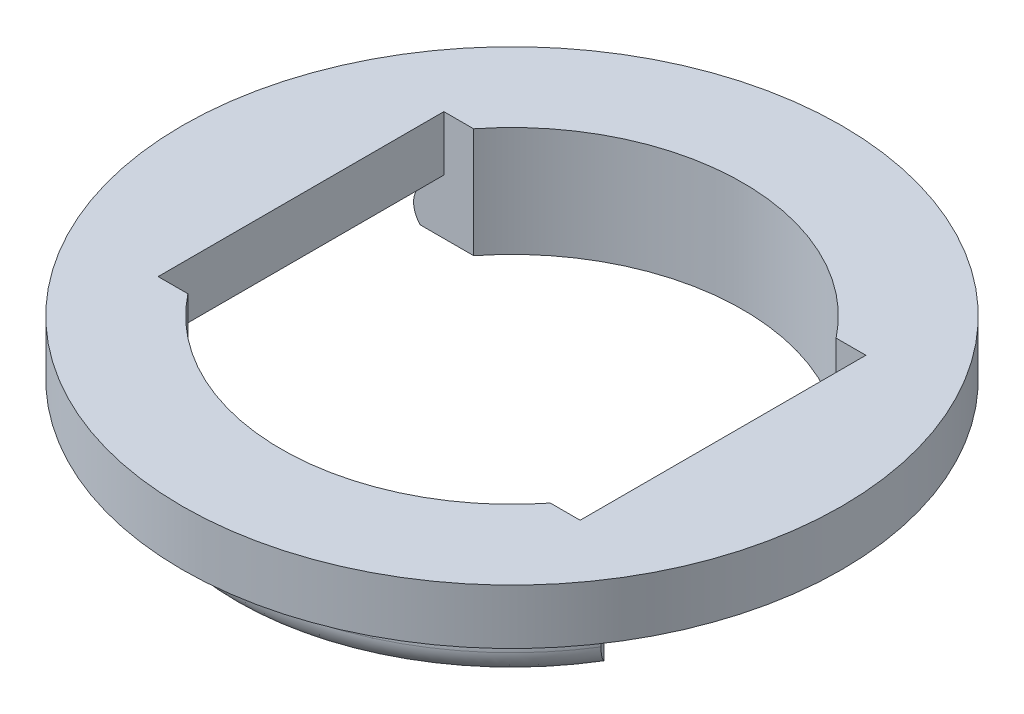
ISO-10303-21;
HEADER;
FILE_DESCRIPTION(('STEP AP214'),'2;1');
FILE_NAME('part.step','',(''),(''),'','','');
FILE_SCHEMA(('AUTOMOTIVE_DESIGN { 1 0 10303 214 1 1 1 1 }'));
ENDSEC;
DATA;
#1=APPLICATION_CONTEXT('core data for automotive mechanical design processes');
#2=APPLICATION_PROTOCOL_DEFINITION('international standard','automotive_design',2000,#1);
#3=PRODUCT_CONTEXT('',#1,'mechanical');
#4=PRODUCT('Part','Part','',(#3));
#5=PRODUCT_RELATED_PRODUCT_CATEGORY('part','',(#4));
#6=PRODUCT_DEFINITION_FORMATION('','',#4);
#7=PRODUCT_DEFINITION_CONTEXT('part definition',#1,'design');
#8=PRODUCT_DEFINITION('design','',#6,#7);
#9=PRODUCT_DEFINITION_SHAPE('','',#8);
#10=(LENGTH_UNIT() NAMED_UNIT(*) SI_UNIT(.MILLI.,.METRE.));
#11=(NAMED_UNIT(*) PLANE_ANGLE_UNIT() SI_UNIT($,.RADIAN.));
#12=(NAMED_UNIT(*) SI_UNIT($,.STERADIAN.) SOLID_ANGLE_UNIT());
#13=UNCERTAINTY_MEASURE_WITH_UNIT(LENGTH_MEASURE(1.E-05),#10,'distance_accuracy_value','');
#14=(GEOMETRIC_REPRESENTATION_CONTEXT(3) GLOBAL_UNCERTAINTY_ASSIGNED_CONTEXT((#13)) GLOBAL_UNIT_ASSIGNED_CONTEXT((#10,
#11,#12)) REPRESENTATION_CONTEXT('',''));
#15=CARTESIAN_POINT('',(0.,0.,0.));
#16=DIRECTION('',(0.,0.,1.));
#17=DIRECTION('',(1.,0.,0.));
#18=AXIS2_PLACEMENT_3D('',#15,#16,#17);
#19=CARTESIAN_POINT('',(0.,-2.5,0.));
#20=DIRECTION('',(0.,1.,0.));
#21=DIRECTION('',(0.,0.,1.));
#22=AXIS2_PLACEMENT_3D('',#19,#20,#21);
#23=CYLINDRICAL_SURFACE('',#22,12.5);
#24=CARTESIAN_POINT('',(0.,-1.,0.));
#25=DIRECTION('',(0.,-1.,0.));
#26=DIRECTION('',(-0.854166260162505,0.,-0.52));
#27=AXIS2_PLACEMENT_3D('',#24,#25,#26);
#28=CIRCLE('',#27,12.5);
#29=CARTESIAN_POINT('',(-10.6770782520313,-1.,-6.5));
#30=VERTEX_POINT('',#29);
#31=CARTESIAN_POINT('',(10.6770782520313,-1.,-6.5));
#32=VERTEX_POINT('',#31);
#33=EDGE_CURVE('E58',#30,#32,#28,.T.);
#34=ORIENTED_EDGE('',*,*,#33,.F.);
#35=DIRECTION('',(0.,1.,0.));
#36=VECTOR('',#35,1.);
#37=CARTESIAN_POINT('',(-10.6770782520313,-2.5,-6.5));
#38=LINE('',#37,#36);
#39=CARTESIAN_POINT('',(-10.6770782520313,0.,-6.5));
#40=VERTEX_POINT('',#39);
#41=EDGE_CURVE('E169',#30,#40,#38,.T.);
#42=ORIENTED_EDGE('',*,*,#41,.T.);
#43=CARTESIAN_POINT('',(0.,0.,0.));
#44=DIRECTION('',(0.,-1.,0.));
#45=DIRECTION('',(0.,0.,-1.));
#46=AXIS2_PLACEMENT_3D('',#43,#44,#45);
#47=CIRCLE('',#46,12.5);
#48=CARTESIAN_POINT('',(10.6770782520313,0.,-6.5));
#49=VERTEX_POINT('',#48);
#50=EDGE_CURVE('E172',#40,#49,#47,.T.);
#51=ORIENTED_EDGE('',*,*,#50,.T.);
#52=DIRECTION('',(0.,1.,0.));
#53=VECTOR('',#52,1.);
#54=CARTESIAN_POINT('',(10.6770782520313,-2.5,-6.5));
#55=LINE('',#54,#53);
#56=EDGE_CURVE('E160',#32,#49,#55,.T.);
#57=ORIENTED_EDGE('',*,*,#56,.F.);
#58=EDGE_LOOP('',(#34,#42,#51,#57));
#59=FACE_BOUND('',#58,.T.);
#60=ADVANCED_FACE('F41',(#59),#23,.T.);
#61=CARTESIAN_POINT('',(0.,-2.5,0.));
#62=DIRECTION('',(0.,1.,0.));
#63=DIRECTION('',(0.,0.,1.));
#64=AXIS2_PLACEMENT_3D('',#61,#62,#63);
#65=CYLINDRICAL_SURFACE('',#64,12.5);
#66=CARTESIAN_POINT('',(0.,-1.,0.));
#67=DIRECTION('',(0.,-1.,0.));
#68=DIRECTION('',(0.854166260162505,0.,0.52));
#69=AXIS2_PLACEMENT_3D('',#66,#67,#68);
#70=CIRCLE('',#69,12.5);
#71=CARTESIAN_POINT('',(10.6770782520313,-1.,6.5));
#72=VERTEX_POINT('',#71);
#73=CARTESIAN_POINT('',(-10.6770782520313,-1.,6.5));
#74=VERTEX_POINT('',#73);
#75=EDGE_CURVE('E66',#72,#74,#70,.T.);
#76=ORIENTED_EDGE('',*,*,#75,.F.);
#77=DIRECTION('',(0.,1.,0.));
#78=VECTOR('',#77,1.);
#79=CARTESIAN_POINT('',(10.6770782520313,-2.5,6.5));
#80=LINE('',#79,#78);
#81=CARTESIAN_POINT('',(10.6770782520313,0.,6.5));
#82=VERTEX_POINT('',#81);
#83=EDGE_CURVE('E286',#72,#82,#80,.T.);
#84=ORIENTED_EDGE('',*,*,#83,.T.);
#85=CARTESIAN_POINT('',(0.,0.,0.));
#86=DIRECTION('',(0.,-1.,0.));
#87=DIRECTION('',(0.,0.,-1.));
#88=AXIS2_PLACEMENT_3D('',#85,#86,#87);
#89=CIRCLE('',#88,12.5);
#90=CARTESIAN_POINT('',(-10.6770782520313,0.,6.5));
#91=VERTEX_POINT('',#90);
#92=EDGE_CURVE('E259',#82,#91,#89,.T.);
#93=ORIENTED_EDGE('',*,*,#92,.T.);
#94=DIRECTION('',(0.,1.,0.));
#95=VECTOR('',#94,1.);
#96=CARTESIAN_POINT('',(-10.6770782520313,-2.5,6.5));
#97=LINE('',#96,#95);
#98=EDGE_CURVE('E283',#74,#91,#97,.T.);
#99=ORIENTED_EDGE('',*,*,#98,.F.);
#100=EDGE_LOOP('',(#76,#84,#93,#99));
#101=FACE_BOUND('',#100,.T.);
#102=ADVANCED_FACE('F359',(#101),#65,.T.);
#103=CARTESIAN_POINT('',(0.,2.5,-6.50000000000001));
#104=DIRECTION('',(0.,0.,-1.));
#105=DIRECTION('',(-1.,0.,0.));
#106=AXIS2_PLACEMENT_3D('',#103,#104,#105);
#107=PLANE('',#106);
#108=DIRECTION('',(1.,0.,0.));
#109=VECTOR('',#108,1.);
#110=CARTESIAN_POINT('',(0.,2.5,-6.50000000000001));
#111=LINE('',#110,#109);
#112=CARTESIAN_POINT('',(8.24621125123532,2.5,-6.5));
#113=VERTEX_POINT('',#112);
#114=CARTESIAN_POINT('',(9.6,2.5,-6.5));
#115=VERTEX_POINT('',#114);
#116=EDGE_CURVE('E304',#113,#115,#111,.T.);
#117=ORIENTED_EDGE('',*,*,#116,.F.);
#118=DIRECTION('',(0.,1.,0.));
#119=VECTOR('',#118,1.);
#120=CARTESIAN_POINT('',(8.24621125123532,-2.5,-6.5));
#121=LINE('',#120,#119);
#122=CARTESIAN_POINT('',(8.24621125123532,-2.5,-6.5));
#123=VERTEX_POINT('',#122);
#124=EDGE_CURVE('E175',#123,#113,#121,.T.);
#125=ORIENTED_EDGE('',*,*,#124,.F.);
#126=DIRECTION('',(-1.,0.,0.));
#127=VECTOR('',#126,1.);
#128=CARTESIAN_POINT('',(0.,-2.5,-6.5));
#129=LINE('',#128,#127);
#130=CARTESIAN_POINT('',(10.6770782520313,-2.5,-6.5));
#131=VERTEX_POINT('',#130);
#132=EDGE_CURVE('E163',#131,#123,#129,.T.);
#133=ORIENTED_EDGE('',*,*,#132,.F.);
#134=EDGE_CURVE('E157',#131,#32,#55,.T.);
#135=ORIENTED_EDGE('',*,*,#134,.T.);
#136=ORIENTED_EDGE('',*,*,#56,.T.);
#137=DIRECTION('',(-1.,0.,0.));
#138=VECTOR('',#137,1.);
#139=CARTESIAN_POINT('',(0.,0.,-6.5));
#140=LINE('',#139,#138);
#141=CARTESIAN_POINT('',(9.6,0.,-6.5));
#142=VERTEX_POINT('',#141);
#143=EDGE_CURVE('E237',#49,#142,#140,.T.);
#144=ORIENTED_EDGE('',*,*,#143,.T.);
#145=DIRECTION('',(0.,-1.,0.));
#146=VECTOR('',#145,1.);
#147=CARTESIAN_POINT('',(9.6,2.5,-6.5));
#148=LINE('',#147,#146);
#149=EDGE_CURVE('E334',#115,#142,#148,.T.);
#150=ORIENTED_EDGE('',*,*,#149,.F.);
#151=EDGE_LOOP('',(#117,#125,#133,#135,#136,#144,#150));
#152=FACE_BOUND('',#151,.T.);
#153=ADVANCED_FACE('F159',(#152),#107,.F.);
#154=CARTESIAN_POINT('',(0.,2.5,6.49999999999999));
#155=DIRECTION('',(0.,0.,1.));
#156=DIRECTION('',(1.,0.,0.));
#157=AXIS2_PLACEMENT_3D('',#154,#155,#156);
#158=PLANE('',#157);
#159=DIRECTION('',(-1.,0.,0.));
#160=VECTOR('',#159,1.);
#161=CARTESIAN_POINT('',(0.,2.5,6.49999999999999));
#162=LINE('',#161,#160);
#163=CARTESIAN_POINT('',(-8.24621125123532,2.5,6.5));
#164=VERTEX_POINT('',#163);
#165=CARTESIAN_POINT('',(-9.6,2.5,6.5));
#166=VERTEX_POINT('',#165);
#167=EDGE_CURVE('E313',#164,#166,#162,.T.);
#168=ORIENTED_EDGE('',*,*,#167,.F.);
#169=DIRECTION('',(0.,1.,0.));
#170=VECTOR('',#169,1.);
#171=CARTESIAN_POINT('',(-8.24621125123532,-2.5,6.5));
#172=LINE('',#171,#170);
#173=CARTESIAN_POINT('',(-8.24621125123532,-2.5,6.5));
#174=VERTEX_POINT('',#173);
#175=EDGE_CURVE('E273',#174,#164,#172,.T.);
#176=ORIENTED_EDGE('',*,*,#175,.F.);
#177=DIRECTION('',(1.,0.,0.));
#178=VECTOR('',#177,1.);
#179=CARTESIAN_POINT('',(0.,-2.5,6.5));
#180=LINE('',#179,#178);
#181=CARTESIAN_POINT('',(-10.6770782520313,-2.5,6.5));
#182=VERTEX_POINT('',#181);
#183=EDGE_CURVE('E271',#182,#174,#180,.T.);
#184=ORIENTED_EDGE('',*,*,#183,.F.);
#185=CARTESIAN_POINT('',(-9.88957825203131,-1.75,6.5));
#186=DIRECTION('',(0.,0.,1.));
#187=DIRECTION('',(1.,0.,0.));
#188=AXIS2_PLACEMENT_3D('',#185,#186,#187);
#189=CIRCLE('',#188,1.0875);
#190=CARTESIAN_POINT('',(-10.9770782520313,-1.75,6.5));
#191=VERTEX_POINT('',#190);
#192=EDGE_CURVE('E216',#191,#182,#189,.T.);
#193=ORIENTED_EDGE('',*,*,#192,.F.);
#194=CARTESIAN_POINT('',(-9.88957825203131,-1.75,6.5));
#195=DIRECTION('',(0.,0.,-1.));
#196=DIRECTION('',(-1.,0.,0.));
#197=AXIS2_PLACEMENT_3D('',#194,#195,#196);
#198=CIRCLE('',#197,1.0875);
#199=EDGE_CURVE('E205',#74,#191,#198,.F.);
#200=ORIENTED_EDGE('',*,*,#199,.F.);
#201=ORIENTED_EDGE('',*,*,#98,.T.);
#202=DIRECTION('',(1.,0.,0.));
#203=VECTOR('',#202,1.);
#204=CARTESIAN_POINT('',(0.,0.,6.5));
#205=LINE('',#204,#203);
#206=CARTESIAN_POINT('',(-9.6,0.,6.5));
#207=VERTEX_POINT('',#206);
#208=EDGE_CURVE('E265',#91,#207,#205,.T.);
#209=ORIENTED_EDGE('',*,*,#208,.T.);
#210=DIRECTION('',(0.,-1.,0.));
#211=VECTOR('',#210,1.);
#212=CARTESIAN_POINT('',(-9.6,2.5,6.5));
#213=LINE('',#212,#211);
#214=EDGE_CURVE('E318',#166,#207,#213,.T.);
#215=ORIENTED_EDGE('',*,*,#214,.F.);
#216=EDGE_LOOP('',(#168,#176,#184,#193,#200,#201,#209,#215));
#217=FACE_BOUND('',#216,.T.);
#218=ADVANCED_FACE('F356',(#217),#158,.F.);
#219=CARTESIAN_POINT('',(0.,0.,0.));
#220=DIRECTION('',(0.,1.,0.));
#221=DIRECTION('',(0.,0.,1.));
#222=AXIS2_PLACEMENT_3D('',#219,#220,#221);
#223=PLANE('',#222);
#224=CARTESIAN_POINT('',(0.,0.,0.));
#225=DIRECTION('',(0.,1.,0.));
#226=DIRECTION('',(0.,0.,1.));
#227=AXIS2_PLACEMENT_3D('',#224,#225,#226);
#228=CIRCLE('',#227,15.);
#229=CARTESIAN_POINT('',(0.,0.,15.));
#230=VERTEX_POINT('',#229);
#231=EDGE_CURVE('E294',#230,#230,#228,.T.);
#232=ORIENTED_EDGE('',*,*,#231,.F.);
#233=EDGE_LOOP('',(#232));
#234=FACE_BOUND('',#233,.T.);
#235=DIRECTION('',(-1.,0.,0.));
#236=VECTOR('',#235,1.);
#237=CARTESIAN_POINT('',(0.,0.,-6.50000000000001));
#238=LINE('',#237,#236);
#239=CARTESIAN_POINT('',(-9.6,0.,-6.50000000000001));
#240=VERTEX_POINT('',#239);
#241=EDGE_CURVE('E228',#240,#40,#238,.T.);
#242=ORIENTED_EDGE('',*,*,#241,.F.);
#243=DIRECTION('',(0.,0.,1.));
#244=VECTOR('',#243,1.);
#245=CARTESIAN_POINT('',(-9.6,0.,0.));
#246=LINE('',#245,#244);
#247=EDGE_CURVE('E322',#240,#207,#246,.T.);
#248=ORIENTED_EDGE('',*,*,#247,.T.);
#249=ORIENTED_EDGE('',*,*,#208,.F.);
#250=ORIENTED_EDGE('',*,*,#92,.F.);
#251=DIRECTION('',(1.,0.,0.));
#252=VECTOR('',#251,1.);
#253=CARTESIAN_POINT('',(0.,0.,6.49999999999999));
#254=LINE('',#253,#252);
#255=CARTESIAN_POINT('',(9.6,0.,6.49999999999999));
#256=VERTEX_POINT('',#255);
#257=EDGE_CURVE('E11',#256,#82,#254,.T.);
#258=ORIENTED_EDGE('',*,*,#257,.F.);
#259=DIRECTION('',(0.,0.,1.));
#260=VECTOR('',#259,1.);
#261=CARTESIAN_POINT('',(9.6,0.,0.));
#262=LINE('',#261,#260);
#263=EDGE_CURVE('E300',#142,#256,#262,.T.);
#264=ORIENTED_EDGE('',*,*,#263,.F.);
#265=ORIENTED_EDGE('',*,*,#143,.F.);
#266=ORIENTED_EDGE('',*,*,#50,.F.);
#267=EDGE_LOOP('',(#242,#248,#249,#250,#258,#264,#265,#266));
#268=FACE_BOUND('',#267,.T.);
#269=ADVANCED_FACE('F352',(#234,#268),#223,.F.);
#270=CARTESIAN_POINT('',(-9.6,2.5,0.));
#271=DIRECTION('',(1.,0.,0.));
#272=DIRECTION('',(0.,0.,-1.));
#273=AXIS2_PLACEMENT_3D('',#270,#271,#272);
#274=PLANE('',#273);
#275=ORIENTED_EDGE('',*,*,#247,.F.);
#276=DIRECTION('',(0.,-1.,0.));
#277=VECTOR('',#276,1.);
#278=CARTESIAN_POINT('',(-9.6,2.5,-6.50000000000001));
#279=LINE('',#278,#277);
#280=CARTESIAN_POINT('',(-9.6,2.5,-6.50000000000001));
#281=VERTEX_POINT('',#280);
#282=EDGE_CURVE('E45',#281,#240,#279,.T.);
#283=ORIENTED_EDGE('',*,*,#282,.F.);
#284=DIRECTION('',(0.,0.,1.));
#285=VECTOR('',#284,1.);
#286=CARTESIAN_POINT('',(-9.6,2.5,0.));
#287=LINE('',#286,#285);
#288=EDGE_CURVE('E299',#281,#166,#287,.T.);
#289=ORIENTED_EDGE('',*,*,#288,.T.);
#290=ORIENTED_EDGE('',*,*,#214,.T.);
#291=EDGE_LOOP('',(#275,#283,#289,#290));
#292=FACE_BOUND('',#291,.T.);
#293=ADVANCED_FACE('F348',(#292),#274,.T.);
#294=DIRECTION('',(0.,1.,0.));
#295=VECTOR('',#294,1.);
#296=CARTESIAN_POINT('',(-8.24621125123531,-2.5,-6.50000000000001));
#297=LINE('',#296,#295);
#298=CARTESIAN_POINT('',(-8.24621125123531,-2.5,-6.50000000000001));
#299=VERTEX_POINT('',#298);
#300=CARTESIAN_POINT('',(-8.24621125123531,2.5,-6.50000000000001));
#301=VERTEX_POINT('',#300);
#302=EDGE_CURVE('E256',#299,#301,#297,.T.);
#303=ORIENTED_EDGE('',*,*,#302,.T.);
#304=EDGE_CURVE('E305',#281,#301,#111,.T.);
#305=ORIENTED_EDGE('',*,*,#304,.F.);
#306=ORIENTED_EDGE('',*,*,#282,.T.);
#307=ORIENTED_EDGE('',*,*,#241,.T.);
#308=ORIENTED_EDGE('',*,*,#41,.F.);
#309=CARTESIAN_POINT('',(-9.88957825203131,-1.75,-6.50000000000001));
#310=DIRECTION('',(0.,0.,-1.));
#311=DIRECTION('',(-1.,0.,0.));
#312=AXIS2_PLACEMENT_3D('',#309,#310,#311);
#313=CIRCLE('',#312,1.0875);
#314=CARTESIAN_POINT('',(-10.9770782520313,-1.75,-6.50000000000001));
#315=VERTEX_POINT('',#314);
#316=EDGE_CURVE('E188',#30,#315,#313,.F.);
#317=ORIENTED_EDGE('',*,*,#316,.T.);
#318=CARTESIAN_POINT('',(-9.88957825203131,-1.75,-6.50000000000001));
#319=DIRECTION('',(0.,0.,1.));
#320=DIRECTION('',(1.,0.,0.));
#321=AXIS2_PLACEMENT_3D('',#318,#319,#320);
#322=CIRCLE('',#321,1.0875);
#323=CARTESIAN_POINT('',(-10.6770782520313,-2.5,-6.5));
#324=VERTEX_POINT('',#323);
#325=EDGE_CURVE('E190',#315,#324,#322,.T.);
#326=ORIENTED_EDGE('',*,*,#325,.T.);
#327=DIRECTION('',(-1.,0.,0.));
#328=VECTOR('',#327,1.);
#329=CARTESIAN_POINT('',(0.,-2.5,-6.50000000000001));
#330=LINE('',#329,#328);
#331=EDGE_CURVE('E236',#299,#324,#330,.T.);
#332=ORIENTED_EDGE('',*,*,#331,.F.);
#333=EDGE_LOOP('',(#303,#305,#306,#307,#308,#317,#326,#332));
#334=FACE_BOUND('',#333,.T.);
#335=ADVANCED_FACE('F345',(#334),#107,.F.);
#336=CARTESIAN_POINT('',(9.6,2.5,0.));
#337=DIRECTION('',(1.,0.,0.));
#338=DIRECTION('',(0.,0.,-1.));
#339=AXIS2_PLACEMENT_3D('',#336,#337,#338);
#340=PLANE('',#339);
#341=ORIENTED_EDGE('',*,*,#263,.T.);
#342=DIRECTION('',(0.,-1.,0.));
#343=VECTOR('',#342,1.);
#344=CARTESIAN_POINT('',(9.6,2.5,6.49999999999999));
#345=LINE('',#344,#343);
#346=CARTESIAN_POINT('',(9.6,2.5,6.49999999999999));
#347=VERTEX_POINT('',#346);
#348=EDGE_CURVE('E331',#347,#256,#345,.T.);
#349=ORIENTED_EDGE('',*,*,#348,.F.);
#350=DIRECTION('',(0.,0.,1.));
#351=VECTOR('',#350,1.);
#352=CARTESIAN_POINT('',(9.6,2.5,0.));
#353=LINE('',#352,#351);
#354=EDGE_CURVE('E309',#115,#347,#353,.T.);
#355=ORIENTED_EDGE('',*,*,#354,.F.);
#356=ORIENTED_EDGE('',*,*,#149,.T.);
#357=EDGE_LOOP('',(#341,#349,#355,#356));
#358=FACE_BOUND('',#357,.T.);
#359=ADVANCED_FACE('F366',(#358),#340,.F.);
#360=CARTESIAN_POINT('',(0.,2.5,0.));
#361=DIRECTION('',(0.,-1.,0.));
#362=DIRECTION('',(0.,0.,-1.));
#363=AXIS2_PLACEMENT_3D('',#360,#361,#362);
#364=CYLINDRICAL_SURFACE('',#363,15.);
#365=CARTESIAN_POINT('',(0.,2.5,0.));
#366=DIRECTION('',(0.,1.,0.));
#367=DIRECTION('',(0.,0.,1.));
#368=AXIS2_PLACEMENT_3D('',#365,#366,#367);
#369=CIRCLE('',#368,15.);
#370=CARTESIAN_POINT('',(0.,2.5,15.));
#371=VERTEX_POINT('',#370);
#372=EDGE_CURVE('E295',#371,#371,#369,.T.);
#373=ORIENTED_EDGE('',*,*,#372,.F.);
#374=EDGE_LOOP('',(#373));
#375=FACE_BOUND('',#374,.T.);
#376=ORIENTED_EDGE('',*,*,#231,.T.);
#377=EDGE_LOOP('',(#376));
#378=FACE_BOUND('',#377,.T.);
#379=ADVANCED_FACE('F43',(#375,#378),#364,.T.);
#380=DIRECTION('',(0.,1.,0.));
#381=VECTOR('',#380,1.);
#382=CARTESIAN_POINT('',(8.24621125123533,-2.5,6.49999999999999));
#383=LINE('',#382,#381);
#384=CARTESIAN_POINT('',(8.24621125123533,-2.5,6.49999999999999));
#385=VERTEX_POINT('',#384);
#386=CARTESIAN_POINT('',(8.24621125123533,2.5,6.49999999999999));
#387=VERTEX_POINT('',#386);
#388=EDGE_CURVE('E291',#385,#387,#383,.T.);
#389=ORIENTED_EDGE('',*,*,#388,.T.);
#390=EDGE_CURVE('E314',#347,#387,#162,.T.);
#391=ORIENTED_EDGE('',*,*,#390,.F.);
#392=ORIENTED_EDGE('',*,*,#348,.T.);
#393=ORIENTED_EDGE('',*,*,#257,.T.);
#394=ORIENTED_EDGE('',*,*,#83,.F.);
#395=CARTESIAN_POINT('',(10.6770782520313,-2.5,6.5));
#396=VERTEX_POINT('',#395);
#397=EDGE_CURVE('E287',#396,#72,#80,.T.);
#398=ORIENTED_EDGE('',*,*,#397,.F.);
#399=DIRECTION('',(1.,0.,0.));
#400=VECTOR('',#399,1.);
#401=CARTESIAN_POINT('',(0.,-2.5,6.49999999999999));
#402=LINE('',#401,#400);
#403=EDGE_CURVE('E264',#385,#396,#402,.T.);
#404=ORIENTED_EDGE('',*,*,#403,.F.);
#405=EDGE_LOOP('',(#389,#391,#392,#393,#394,#398,#404));
#406=FACE_BOUND('',#405,.T.);
#407=ADVANCED_FACE('F362',(#406),#158,.F.);
#408=CARTESIAN_POINT('',(0.,2.5,0.));
#409=DIRECTION('',(0.,1.,0.));
#410=DIRECTION('',(0.,0.,1.));
#411=AXIS2_PLACEMENT_3D('',#408,#409,#410);
#412=PLANE('',#411);
#413=CARTESIAN_POINT('',(0.,2.5,0.));
#414=DIRECTION('',(0.,-1.,0.));
#415=DIRECTION('',(0.,0.,-1.));
#416=AXIS2_PLACEMENT_3D('',#413,#414,#415);
#417=CIRCLE('',#416,10.5);
#418=EDGE_CURVE('E224',#387,#164,#417,.T.);
#419=ORIENTED_EDGE('',*,*,#418,.T.);
#420=ORIENTED_EDGE('',*,*,#167,.T.);
#421=ORIENTED_EDGE('',*,*,#288,.F.);
#422=ORIENTED_EDGE('',*,*,#304,.T.);
#423=CARTESIAN_POINT('',(0.,2.5,0.));
#424=DIRECTION('',(0.,-1.,0.));
#425=DIRECTION('',(0.,0.,-1.));
#426=AXIS2_PLACEMENT_3D('',#423,#424,#425);
#427=CIRCLE('',#426,10.5);
#428=EDGE_CURVE('E223',#301,#113,#427,.T.);
#429=ORIENTED_EDGE('',*,*,#428,.T.);
#430=ORIENTED_EDGE('',*,*,#116,.T.);
#431=ORIENTED_EDGE('',*,*,#354,.T.);
#432=ORIENTED_EDGE('',*,*,#390,.T.);
#433=EDGE_LOOP('',(#419,#420,#421,#422,#429,#430,#431,#432));
#434=FACE_BOUND('',#433,.T.);
#435=ORIENTED_EDGE('',*,*,#372,.T.);
#436=EDGE_LOOP('',(#435));
#437=FACE_BOUND('',#436,.T.);
#438=ADVANCED_FACE('F371',(#434,#437),#412,.T.);
#439=CARTESIAN_POINT('',(0.,-2.5,0.));
#440=DIRECTION('',(0.,1.,0.));
#441=DIRECTION('',(0.,0.,1.));
#442=AXIS2_PLACEMENT_3D('',#439,#440,#441);
#443=CYLINDRICAL_SURFACE('',#442,10.5);
#444=ORIENTED_EDGE('',*,*,#175,.T.);
#445=ORIENTED_EDGE('',*,*,#418,.F.);
#446=ORIENTED_EDGE('',*,*,#388,.F.);
#447=CARTESIAN_POINT('',(0.,-2.5,0.));
#448=DIRECTION('',(0.,-1.,0.));
#449=DIRECTION('',(0.,0.,-1.));
#450=AXIS2_PLACEMENT_3D('',#447,#448,#449);
#451=CIRCLE('',#450,10.5);
#452=EDGE_CURVE('E260',#385,#174,#451,.T.);
#453=ORIENTED_EDGE('',*,*,#452,.T.);
#454=EDGE_LOOP('',(#444,#445,#446,#453));
#455=FACE_BOUND('',#454,.T.);
#456=ADVANCED_FACE('F378',(#455),#443,.F.);
#457=CARTESIAN_POINT('',(0.,-2.5,0.));
#458=DIRECTION('',(0.,-1.,0.));
#459=DIRECTION('',(0.,0.,-1.));
#460=AXIS2_PLACEMENT_3D('',#457,#458,#459);
#461=PLANE('',#460);
#462=ORIENTED_EDGE('',*,*,#452,.F.);
#463=ORIENTED_EDGE('',*,*,#403,.T.);
#464=CARTESIAN_POINT('',(0.,-2.5,0.));
#465=DIRECTION('',(0.,-1.,0.));
#466=DIRECTION('',(0.,0.,-1.));
#467=AXIS2_PLACEMENT_3D('',#464,#465,#466);
#468=CIRCLE('',#467,12.5);
#469=EDGE_CURVE('E268',#396,#182,#468,.T.);
#470=ORIENTED_EDGE('',*,*,#469,.T.);
#471=ORIENTED_EDGE('',*,*,#183,.T.);
#472=EDGE_LOOP('',(#462,#463,#470,#471));
#473=FACE_BOUND('',#472,.T.);
#474=ADVANCED_FACE('F381',(#473),#461,.T.);
#475=CARTESIAN_POINT('',(0.,-2.5,0.));
#476=DIRECTION('',(0.,1.,0.));
#477=DIRECTION('',(0.,0.,1.));
#478=AXIS2_PLACEMENT_3D('',#475,#476,#477);
#479=CYLINDRICAL_SURFACE('',#478,10.5);
#480=ORIENTED_EDGE('',*,*,#124,.T.);
#481=ORIENTED_EDGE('',*,*,#428,.F.);
#482=ORIENTED_EDGE('',*,*,#302,.F.);
#483=CARTESIAN_POINT('',(0.,-2.5,0.));
#484=DIRECTION('',(0.,-1.,0.));
#485=DIRECTION('',(0.,0.,-1.));
#486=AXIS2_PLACEMENT_3D('',#483,#484,#485);
#487=CIRCLE('',#486,10.5);
#488=EDGE_CURVE('E232',#299,#123,#487,.T.);
#489=ORIENTED_EDGE('',*,*,#488,.T.);
#490=EDGE_LOOP('',(#480,#481,#482,#489));
#491=FACE_BOUND('',#490,.T.);
#492=ADVANCED_FACE('F399',(#491),#479,.F.);
#493=CARTESIAN_POINT('',(0.,-2.5,0.));
#494=DIRECTION('',(0.,-1.,0.));
#495=DIRECTION('',(0.,0.,-1.));
#496=AXIS2_PLACEMENT_3D('',#493,#494,#495);
#497=PLANE('',#496);
#498=ORIENTED_EDGE('',*,*,#488,.F.);
#499=ORIENTED_EDGE('',*,*,#331,.T.);
#500=CARTESIAN_POINT('',(0.,-2.5,0.));
#501=DIRECTION('',(0.,-1.,0.));
#502=DIRECTION('',(0.,0.,-1.));
#503=AXIS2_PLACEMENT_3D('',#500,#501,#502);
#504=CIRCLE('',#503,12.5);
#505=EDGE_CURVE('E240',#324,#131,#504,.T.);
#506=ORIENTED_EDGE('',*,*,#505,.T.);
#507=ORIENTED_EDGE('',*,*,#132,.T.);
#508=EDGE_LOOP('',(#498,#499,#506,#507));
#509=FACE_BOUND('',#508,.T.);
#510=ADVANCED_FACE('F391',(#509),#497,.T.);
#511=CARTESIAN_POINT('',(10.3154582520313,-1.75,5.80043783292691));
#512=DIRECTION('',(-0.888332910569005,0.,0.4592));
#513=DIRECTION('',(0.4592,0.,0.888332910569005));
#514=AXIS2_PLACEMENT_3D('',#511,#512,#513);
#515=PLANE('',#514);
#516=ORIENTED_EDGE('',*,*,#397,.T.);
#517=CARTESIAN_POINT('',(10.3154582520313,-1.75,5.80043783292691));
#518=DIRECTION('',(-0.888332910569005,0.,0.4592));
#519=DIRECTION('',(0.4592,0.,0.888332910569005));
#520=AXIS2_PLACEMENT_3D('',#517,#518,#519);
#521=CIRCLE('',#520,1.0875);
#522=CARTESIAN_POINT('',(10.8148382520313,-1.75,6.7664998731707));
#523=VERTEX_POINT('',#522);
#524=EDGE_CURVE('E202',#72,#523,#521,.F.);
#525=ORIENTED_EDGE('',*,*,#524,.T.);
#526=CARTESIAN_POINT('',(10.3154582520313,-1.75,5.80043783292691));
#527=DIRECTION('',(0.888332910569005,0.,-0.4592));
#528=DIRECTION('',(-0.4592,0.,-0.888332910569005));
#529=AXIS2_PLACEMENT_3D('',#526,#527,#528);
#530=CIRCLE('',#529,1.0875);
#531=EDGE_CURVE('E206',#523,#396,#530,.T.);
#532=ORIENTED_EDGE('',*,*,#531,.T.);
#533=EDGE_LOOP('',(#516,#525,#532));
#534=FACE_BOUND('',#533,.T.);
#535=ADVANCED_FACE('F389',(#534),#515,.F.);
#536=CARTESIAN_POINT('',(10.6770782520313,-1.,6.5));
#537=CARTESIAN_POINT('',(5.23386188825064,-1.,15.4411764705882));
#538=CARTESIAN_POINT('',(-5.23386188825065,-1.,15.4411764705882));
#539=CARTESIAN_POINT('',(-10.6770782520313,-1.,6.5));
#540=CARTESIAN_POINT('',(10.7666190543087,-1.20474268813417,6.67321873149329));
#541=CARTESIAN_POINT('',(5.17834622379297,-1.20474268813417,15.6893782728788));
#542=CARTESIAN_POINT('',(-5.42885492456891,-1.20474268813417,15.6044671299899));
#543=CARTESIAN_POINT('',(-10.8720712883496,-1.20474268813417,6.5));
#544=CARTESIAN_POINT('',(10.8148382520313,-1.46726009733852,6.7664998731707));
#545=CARTESIAN_POINT('',(5.14845012354476,-1.46726009733852,15.823039033955));
#546=CARTESIAN_POINT('',(-5.53386188825065,-1.46726009733852,15.6924018412243));
#547=CARTESIAN_POINT('',(-10.9770782520313,-1.46726009733852,6.5));
#548=CARTESIAN_POINT('',(10.8148382520313,-1.75,6.7664998731707));
#549=CARTESIAN_POINT('',(5.14845012354476,-1.75,15.823039033955));
#550=CARTESIAN_POINT('',(-5.53386188825065,-1.75,15.6924018412243));
#551=CARTESIAN_POINT('',(-10.9770782520313,-1.75,6.5));
#552=(BOUNDED_SURFACE() B_SPLINE_SURFACE(3,3,((#536,#537,#538,#539),(#540,#541,#542,#543),(#544,
#545,#546,#547),(#548,#549,#550,#551)),.UNSPECIFIED.,.F.,.F.,
.F.) B_SPLINE_SURFACE_WITH_KNOTS((4,4),(4,4),(0.,1.),(0.,1.),
.UNSPECIFIED.) GEOMETRIC_REPRESENTATION_ITEM() RATIONAL_B_SPLINE_SURFACE(((1.,0.68,0.68,1.),
(0.952317793923506,0.647576099867984,0.647576099867984,0.952317793923506),(0.952317793923506,
0.647576099867984,0.647576099867984,0.952317793923506),(1.,0.68,0.68,1.))) REPRESENTATION_ITEM('') SURFACE());
#553=CARTESIAN_POINT('',(0.,-1.75,0.));
#554=DIRECTION('',(0.,-1.,0.));
#555=DIRECTION('',(0.847743634328716,0.,0.530406193831804));
#556=AXIS2_PLACEMENT_3D('',#553,#554,#555);
#557=CIRCLE('',#556,12.7572037277461);
#558=EDGE_CURVE('E212',#523,#191,#557,.T.);
#559=ORIENTED_EDGE('',*,*,#558,.F.);
#560=ORIENTED_EDGE('',*,*,#524,.F.);
#561=ORIENTED_EDGE('',*,*,#75,.T.);
#562=ORIENTED_EDGE('',*,*,#199,.T.);
#563=EDGE_LOOP('',(#559,#560,#561,#562));
#564=FACE_BOUND('',#563,.T.);
#565=ADVANCED_FACE('F387',(#564),#552,.F.);
#566=CARTESIAN_POINT('',(10.8148382520313,-1.75,6.7664998731707));
#567=CARTESIAN_POINT('',(5.14845012354476,-1.75,15.823039033955));
#568=CARTESIAN_POINT('',(-5.53386188825065,-1.75,15.6924018412243));
#569=CARTESIAN_POINT('',(-10.9770782520313,-1.75,6.5));
#570=CARTESIAN_POINT('',(10.8148382520313,-2.03273990266148,6.7664998731707));
#571=CARTESIAN_POINT('',(5.14845012354476,-2.03273990266148,15.823039033955));
#572=CARTESIAN_POINT('',(-5.53386188825065,-2.03273990266148,15.6924018412243));
#573=CARTESIAN_POINT('',(-10.9770782520313,-2.03273990266148,6.5));
#574=CARTESIAN_POINT('',(10.7666190543087,-2.29525731186583,6.67321873149329));
#575=CARTESIAN_POINT('',(5.17834622379297,-2.29525731186583,15.6893782728788));
#576=CARTESIAN_POINT('',(-5.42885492456891,-2.29525731186583,15.6044671299899));
#577=CARTESIAN_POINT('',(-10.8720712883496,-2.29525731186583,6.5));
#578=CARTESIAN_POINT('',(10.6770782520313,-2.5,6.5));
#579=CARTESIAN_POINT('',(5.23386188825064,-2.5,15.4411764705882));
#580=CARTESIAN_POINT('',(-5.23386188825065,-2.5,15.4411764705882));
#581=CARTESIAN_POINT('',(-10.6770782520313,-2.5,6.5));
#582=(BOUNDED_SURFACE() B_SPLINE_SURFACE(3,3,((#566,#567,#568,#569),(#570,#571,#572,#573),(#574,
#575,#576,#577),(#578,#579,#580,#581)),.UNSPECIFIED.,.F.,.F.,
.F.) B_SPLINE_SURFACE_WITH_KNOTS((4,4),(4,4),(0.,1.),(0.,1.),
.UNSPECIFIED.) GEOMETRIC_REPRESENTATION_ITEM() RATIONAL_B_SPLINE_SURFACE(((1.,0.68,0.68,1.),
(0.952317793923506,0.647576099867984,0.647576099867984,0.952317793923506),(0.952317793923506,
0.647576099867984,0.647576099867984,0.952317793923506),(1.,0.68,0.68,1.))) REPRESENTATION_ITEM('') SURFACE());
#583=ORIENTED_EDGE('',*,*,#192,.T.);
#584=ORIENTED_EDGE('',*,*,#469,.F.);
#585=ORIENTED_EDGE('',*,*,#531,.F.);
#586=ORIENTED_EDGE('',*,*,#558,.T.);
#587=EDGE_LOOP('',(#583,#584,#585,#586));
#588=FACE_BOUND('',#587,.T.);
#589=ADVANCED_FACE('F384',(#588),#582,.F.);
#590=CARTESIAN_POINT('',(10.3154582520313,-1.75,-5.80043783292691));
#591=DIRECTION('',(0.888332910569005,0.,0.4592));
#592=DIRECTION('',(0.4592,0.,-0.888332910569005));
#593=AXIS2_PLACEMENT_3D('',#590,#591,#592);
#594=PLANE('',#593);
#595=ORIENTED_EDGE('',*,*,#134,.F.);
#596=CARTESIAN_POINT('',(10.3154582520313,-1.75,-5.80043783292691));
#597=DIRECTION('',(-0.888332910569005,0.,-0.4592));
#598=DIRECTION('',(-0.4592,0.,0.888332910569005));
#599=AXIS2_PLACEMENT_3D('',#596,#597,#598);
#600=CIRCLE('',#599,1.0875);
#601=CARTESIAN_POINT('',(10.8148382520313,-1.75,-6.7664998731707));
#602=VERTEX_POINT('',#601);
#603=EDGE_CURVE('E178',#602,#131,#600,.T.);
#604=ORIENTED_EDGE('',*,*,#603,.F.);
#605=CARTESIAN_POINT('',(10.3154582520313,-1.75,-5.80043783292691));
#606=DIRECTION('',(0.888332910569005,0.,0.4592));
#607=DIRECTION('',(0.4592,0.,-0.888332910569005));
#608=AXIS2_PLACEMENT_3D('',#605,#606,#607);
#609=CIRCLE('',#608,1.0875);
#610=EDGE_CURVE('E176',#32,#602,#609,.F.);
#611=ORIENTED_EDGE('',*,*,#610,.F.);
#612=EDGE_LOOP('',(#595,#604,#611));
#613=FACE_BOUND('',#612,.T.);
#614=ADVANCED_FACE('F177',(#613),#594,.T.);
#615=CARTESIAN_POINT('',(-10.6770782520313,-1.,-6.50000000000001));
#616=CARTESIAN_POINT('',(-5.23386188825064,-1.,-15.4411764705882));
#617=CARTESIAN_POINT('',(5.23386188825065,-1.,-15.4411764705882));
#618=CARTESIAN_POINT('',(10.6770782520313,-1.,-6.5));
#619=CARTESIAN_POINT('',(-10.8720712883496,-1.20474268813417,-6.50000000000001));
#620=CARTESIAN_POINT('',(-5.4288549245689,-1.20474268813417,-15.6044671299899));
#621=CARTESIAN_POINT('',(5.17834622379298,-1.20474268813417,-15.6893782728788));
#622=CARTESIAN_POINT('',(10.7666190543087,-1.20474268813417,-6.67321873149329));
#623=CARTESIAN_POINT('',(-10.9770782520313,-1.46726009733852,-6.50000000000001));
#624=CARTESIAN_POINT('',(-5.53386188825064,-1.46726009733852,-15.6924018412243));
#625=CARTESIAN_POINT('',(5.14845012354477,-1.46726009733852,-15.823039033955));
#626=CARTESIAN_POINT('',(10.8148382520313,-1.46726009733852,-6.7664998731707));
#627=CARTESIAN_POINT('',(-10.9770782520313,-1.75,-6.50000000000001));
#628=CARTESIAN_POINT('',(-5.53386188825064,-1.75,-15.6924018412243));
#629=CARTESIAN_POINT('',(5.14845012354477,-1.75,-15.823039033955));
#630=CARTESIAN_POINT('',(10.8148382520313,-1.75,-6.7664998731707));
#631=(BOUNDED_SURFACE() B_SPLINE_SURFACE(3,3,((#615,#616,#617,#618),(#619,#620,#621,#622),(#623,
#624,#625,#626),(#627,#628,#629,#630)),.UNSPECIFIED.,.F.,.F.,
.F.) B_SPLINE_SURFACE_WITH_KNOTS((4,4),(4,4),(0.,1.),(0.,1.),
.UNSPECIFIED.) GEOMETRIC_REPRESENTATION_ITEM() RATIONAL_B_SPLINE_SURFACE(((1.,0.68,0.68,1.),
(0.952317793923506,0.647576099867984,0.647576099867984,0.952317793923506),(0.952317793923506,
0.647576099867984,0.647576099867984,0.952317793923506),(1.,0.68,0.68,1.))) REPRESENTATION_ITEM('') SURFACE());
#632=CARTESIAN_POINT('',(0.,-1.75,0.));
#633=DIRECTION('',(0.,-1.,0.));
#634=DIRECTION('',(-0.86046115483418,0.,-0.50951604589201));
#635=AXIS2_PLACEMENT_3D('',#632,#633,#634);
#636=CIRCLE('',#635,12.7572037277461);
#637=EDGE_CURVE('E183',#315,#602,#636,.T.);
#638=ORIENTED_EDGE('',*,*,#637,.F.);
#639=ORIENTED_EDGE('',*,*,#316,.F.);
#640=ORIENTED_EDGE('',*,*,#33,.T.);
#641=ORIENTED_EDGE('',*,*,#610,.T.);
#642=EDGE_LOOP('',(#638,#639,#640,#641));
#643=FACE_BOUND('',#642,.T.);
#644=ADVANCED_FACE('F186',(#643),#631,.F.);
#645=CARTESIAN_POINT('',(-10.9770782520313,-1.75,-6.50000000000001));
#646=CARTESIAN_POINT('',(-5.53386188825064,-1.75,-15.6924018412243));
#647=CARTESIAN_POINT('',(5.14845012354477,-1.75,-15.823039033955));
#648=CARTESIAN_POINT('',(10.8148382520313,-1.75,-6.7664998731707));
#649=CARTESIAN_POINT('',(-10.9770782520313,-2.03273990266148,-6.50000000000001));
#650=CARTESIAN_POINT('',(-5.53386188825064,-2.03273990266148,-15.6924018412243));
#651=CARTESIAN_POINT('',(5.14845012354477,-2.03273990266148,-15.823039033955));
#652=CARTESIAN_POINT('',(10.8148382520313,-2.03273990266148,-6.7664998731707));
#653=CARTESIAN_POINT('',(-10.8720712883496,-2.29525731186583,-6.50000000000001));
#654=CARTESIAN_POINT('',(-5.4288549245689,-2.29525731186583,-15.6044671299899));
#655=CARTESIAN_POINT('',(5.17834622379298,-2.29525731186583,-15.6893782728788));
#656=CARTESIAN_POINT('',(10.7666190543087,-2.29525731186583,-6.67321873149329));
#657=CARTESIAN_POINT('',(-10.6770782520313,-2.5,-6.50000000000001));
#658=CARTESIAN_POINT('',(-5.23386188825064,-2.5,-15.4411764705882));
#659=CARTESIAN_POINT('',(5.23386188825065,-2.5,-15.4411764705882));
#660=CARTESIAN_POINT('',(10.6770782520313,-2.5,-6.5));
#661=(BOUNDED_SURFACE() B_SPLINE_SURFACE(3,3,((#645,#646,#647,#648),(#649,#650,#651,#652),(#653,
#654,#655,#656),(#657,#658,#659,#660)),.UNSPECIFIED.,.F.,.F.,
.F.) B_SPLINE_SURFACE_WITH_KNOTS((4,4),(4,4),(0.,1.),(0.,1.),
.UNSPECIFIED.) GEOMETRIC_REPRESENTATION_ITEM() RATIONAL_B_SPLINE_SURFACE(((1.,0.68,0.68,1.),
(0.952317793923506,0.647576099867984,0.647576099867984,0.952317793923506),(0.952317793923506,
0.647576099867984,0.647576099867984,0.952317793923506),(1.,0.68,0.68,1.))) REPRESENTATION_ITEM('') SURFACE());
#662=ORIENTED_EDGE('',*,*,#603,.T.);
#663=ORIENTED_EDGE('',*,*,#505,.F.);
#664=ORIENTED_EDGE('',*,*,#325,.F.);
#665=ORIENTED_EDGE('',*,*,#637,.T.);
#666=EDGE_LOOP('',(#662,#663,#664,#665));
#667=FACE_BOUND('',#666,.T.);
#668=ADVANCED_FACE('F393',(#667),#661,.F.);
#669=CLOSED_SHELL('',(#60,#102,#153,#218,#269,#293,#335,#359,#379,#407,#438,#456,#474,#492,#510,
#535,#565,#589,#614,#644,#668));
#670=MANIFOLD_SOLID_BREP('B2',#669);
#671=ADVANCED_BREP_SHAPE_REPRESENTATION('',(#18,#670),#14);
#672=SHAPE_DEFINITION_REPRESENTATION(#9,#671);
ENDSEC;
END-ISO-10303-21;
